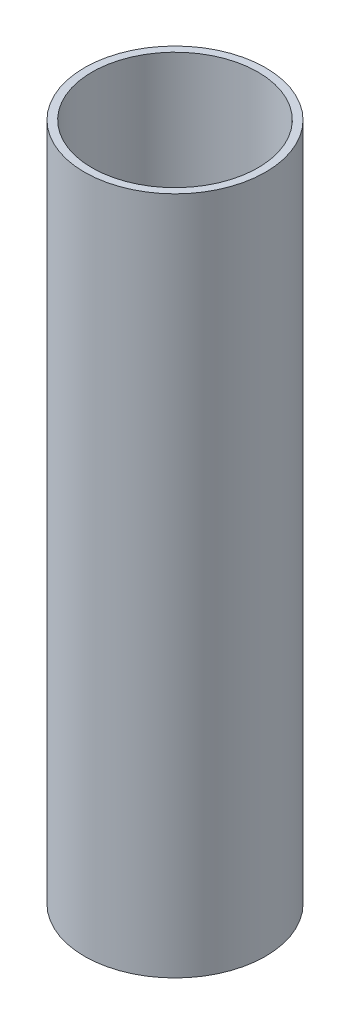
ISO-10303-21;
HEADER;
FILE_DESCRIPTION(('STEP AP214'),'2;1');
FILE_NAME('part.step','',(''),(''),'','','');
FILE_SCHEMA(('AUTOMOTIVE_DESIGN { 1 0 10303 214 1 1 1 1 }'));
ENDSEC;
DATA;
#1=APPLICATION_CONTEXT('core data for automotive mechanical design processes');
#2=APPLICATION_PROTOCOL_DEFINITION('international standard','automotive_design',2000,#1);
#3=PRODUCT_CONTEXT('',#1,'mechanical');
#4=PRODUCT('Part','Part','',(#3));
#5=PRODUCT_RELATED_PRODUCT_CATEGORY('part','',(#4));
#6=PRODUCT_DEFINITION_FORMATION('','',#4);
#7=PRODUCT_DEFINITION_CONTEXT('part definition',#1,'design');
#8=PRODUCT_DEFINITION('design','',#6,#7);
#9=PRODUCT_DEFINITION_SHAPE('','',#8);
#10=(LENGTH_UNIT() NAMED_UNIT(*) SI_UNIT(.MILLI.,.METRE.));
#11=(NAMED_UNIT(*) PLANE_ANGLE_UNIT() SI_UNIT($,.RADIAN.));
#12=(NAMED_UNIT(*) SI_UNIT($,.STERADIAN.) SOLID_ANGLE_UNIT());
#13=UNCERTAINTY_MEASURE_WITH_UNIT(LENGTH_MEASURE(1.E-05),#10,'distance_accuracy_value','');
#14=(GEOMETRIC_REPRESENTATION_CONTEXT(3) GLOBAL_UNCERTAINTY_ASSIGNED_CONTEXT((#13)) GLOBAL_UNIT_ASSIGNED_CONTEXT((#10,
#11,#12)) REPRESENTATION_CONTEXT('',''));
#15=CARTESIAN_POINT('',(0.,0.,0.));
#16=DIRECTION('',(0.,0.,1.));
#17=DIRECTION('',(1.,0.,0.));
#18=AXIS2_PLACEMENT_3D('',#15,#16,#17);
#19=CARTESIAN_POINT('',(0.,180.,0.));
#20=DIRECTION('',(0.,-1.,0.));
#21=DIRECTION('',(0.,0.,-1.));
#22=AXIS2_PLACEMENT_3D('',#19,#20,#21);
#23=CYLINDRICAL_SURFACE('',#22,24.);
#24=CARTESIAN_POINT('',(0.,180.,0.));
#25=DIRECTION('',(0.,1.,0.));
#26=DIRECTION('',(0.,0.,1.));
#27=AXIS2_PLACEMENT_3D('',#24,#25,#26);
#28=CIRCLE('',#27,24.);
#29=CARTESIAN_POINT('',(0.,180.,24.));
#30=VERTEX_POINT('',#29);
#31=EDGE_CURVE('E10',#30,#30,#28,.T.);
#32=ORIENTED_EDGE('',*,*,#31,.F.);
#33=EDGE_LOOP('',(#32));
#34=FACE_BOUND('',#33,.T.);
#35=CARTESIAN_POINT('',(0.,0.,0.));
#36=DIRECTION('',(0.,1.,0.));
#37=DIRECTION('',(0.,0.,1.));
#38=AXIS2_PLACEMENT_3D('',#35,#36,#37);
#39=CIRCLE('',#38,24.);
#40=CARTESIAN_POINT('',(0.,0.,24.));
#41=VERTEX_POINT('',#40);
#42=EDGE_CURVE('E38',#41,#41,#39,.T.);
#43=ORIENTED_EDGE('',*,*,#42,.T.);
#44=EDGE_LOOP('',(#43));
#45=FACE_BOUND('',#44,.T.);
#46=ADVANCED_FACE('F35',(#34,#45),#23,.T.);
#47=CARTESIAN_POINT('',(0.,180.,0.));
#48=DIRECTION('',(0.,1.,0.));
#49=DIRECTION('',(0.,0.,1.));
#50=AXIS2_PLACEMENT_3D('',#47,#48,#49);
#51=PLANE('',#50);
#52=CARTESIAN_POINT('',(0.,180.,0.));
#53=DIRECTION('',(0.,1.,0.));
#54=DIRECTION('',(0.,0.,1.));
#55=AXIS2_PLACEMENT_3D('',#52,#53,#54);
#56=CIRCLE('',#55,22.);
#57=CARTESIAN_POINT('',(0.,180.,22.));
#58=VERTEX_POINT('',#57);
#59=EDGE_CURVE('E47',#58,#58,#56,.T.);
#60=ORIENTED_EDGE('',*,*,#59,.F.);
#61=EDGE_LOOP('',(#60));
#62=FACE_BOUND('',#61,.T.);
#63=ORIENTED_EDGE('',*,*,#31,.T.);
#64=EDGE_LOOP('',(#63));
#65=FACE_BOUND('',#64,.T.);
#66=ADVANCED_FACE('F62',(#62,#65),#51,.T.);
#67=CARTESIAN_POINT('',(0.,0.,0.));
#68=DIRECTION('',(0.,1.,0.));
#69=DIRECTION('',(0.,0.,1.));
#70=AXIS2_PLACEMENT_3D('',#67,#68,#69);
#71=PLANE('',#70);
#72=CARTESIAN_POINT('',(0.,0.,0.));
#73=DIRECTION('',(0.,1.,0.));
#74=DIRECTION('',(0.,0.,1.));
#75=AXIS2_PLACEMENT_3D('',#72,#73,#74);
#76=CIRCLE('',#75,22.);
#77=CARTESIAN_POINT('',(0.,0.,22.));
#78=VERTEX_POINT('',#77);
#79=EDGE_CURVE('E45',#78,#78,#76,.T.);
#80=ORIENTED_EDGE('',*,*,#79,.T.);
#81=EDGE_LOOP('',(#80));
#82=FACE_BOUND('',#81,.T.);
#83=ORIENTED_EDGE('',*,*,#42,.F.);
#84=EDGE_LOOP('',(#83));
#85=FACE_BOUND('',#84,.T.);
#86=ADVANCED_FACE('F53',(#82,#85),#71,.F.);
#87=CARTESIAN_POINT('',(0.,0.,0.));
#88=DIRECTION('',(0.,1.,0.));
#89=DIRECTION('',(0.,0.,1.));
#90=AXIS2_PLACEMENT_3D('',#87,#88,#89);
#91=CYLINDRICAL_SURFACE('',#90,22.);
#92=ORIENTED_EDGE('',*,*,#79,.F.);
#93=EDGE_LOOP('',(#92));
#94=FACE_BOUND('',#93,.T.);
#95=ORIENTED_EDGE('',*,*,#59,.T.);
#96=EDGE_LOOP('',(#95));
#97=FACE_BOUND('',#96,.T.);
#98=ADVANCED_FACE('F56',(#94,#97),#91,.F.);
#99=CLOSED_SHELL('',(#46,#66,#86,#98));
#100=MANIFOLD_SOLID_BREP('B2',#99);
#101=ADVANCED_BREP_SHAPE_REPRESENTATION('',(#18,#100),#14);
#102=SHAPE_DEFINITION_REPRESENTATION(#9,#101);
ENDSEC;
END-ISO-10303-21;
